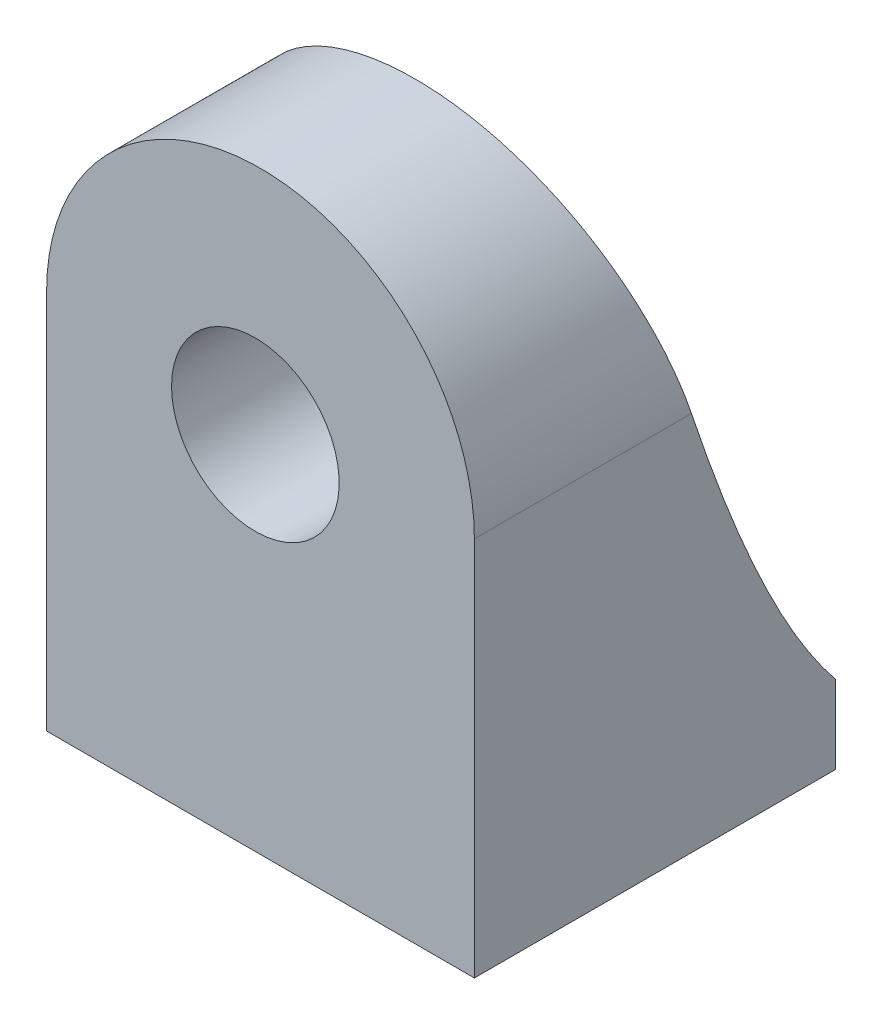
ISO-10303-21;
HEADER;
FILE_DESCRIPTION(('STEP AP214'),'2;1');
FILE_NAME('part.step','',(''),(''),'','','');
FILE_SCHEMA(('AUTOMOTIVE_DESIGN { 1 0 10303 214 1 1 1 1 }'));
ENDSEC;
DATA;
#1=APPLICATION_CONTEXT('core data for automotive mechanical design processes');
#2=APPLICATION_PROTOCOL_DEFINITION('international standard','automotive_design',2000,#1);
#3=PRODUCT_CONTEXT('',#1,'mechanical');
#4=PRODUCT('Part','Part','',(#3));
#5=PRODUCT_RELATED_PRODUCT_CATEGORY('part','',(#4));
#6=PRODUCT_DEFINITION_FORMATION('','',#4);
#7=PRODUCT_DEFINITION_CONTEXT('part definition',#1,'design');
#8=PRODUCT_DEFINITION('design','',#6,#7);
#9=PRODUCT_DEFINITION_SHAPE('','',#8);
#10=(LENGTH_UNIT() NAMED_UNIT(*) SI_UNIT(.MILLI.,.METRE.));
#11=(NAMED_UNIT(*) PLANE_ANGLE_UNIT() SI_UNIT($,.RADIAN.));
#12=(NAMED_UNIT(*) SI_UNIT($,.STERADIAN.) SOLID_ANGLE_UNIT());
#13=UNCERTAINTY_MEASURE_WITH_UNIT(LENGTH_MEASURE(1.E-05),#10,'distance_accuracy_value','');
#14=(GEOMETRIC_REPRESENTATION_CONTEXT(3) GLOBAL_UNCERTAINTY_ASSIGNED_CONTEXT((#13)) GLOBAL_UNIT_ASSIGNED_CONTEXT((#10,
#11,#12)) REPRESENTATION_CONTEXT('',''));
#15=CARTESIAN_POINT('',(0.,0.,0.));
#16=DIRECTION('',(0.,0.,1.));
#17=DIRECTION('',(1.,0.,0.));
#18=AXIS2_PLACEMENT_3D('',#15,#16,#17);
#19=CARTESIAN_POINT('',(-10.1213010765894,-33.8275579371165,28.));
#20=DIRECTION('',(0.,1.,0.));
#21=DIRECTION('',(0.,0.,1.));
#22=AXIS2_PLACEMENT_3D('',#19,#20,#21);
#23=PLANE('',#22);
#24=CARTESIAN_POINT('',(6.46731545091811,-33.8275579371165,8.5));
#25=DIRECTION('',(0.,1.,0.));
#26=DIRECTION('',(0.,0.,1.));
#27=AXIS2_PLACEMENT_3D('',#24,#25,#26);
#28=CIRCLE('',#27,7.);
#29=CARTESIAN_POINT('',(6.46731545091811,-33.8275579371165,15.5));
#30=VERTEX_POINT('',#29);
#31=EDGE_CURVE('E228',#30,#30,#28,.T.);
#32=ORIENTED_EDGE('',*,*,#31,.T.);
#33=EDGE_LOOP('',(#32));
#34=FACE_BOUND('',#33,.T.);
#35=DIRECTION('',(1.,0.,0.));
#36=VECTOR('',#35,1.);
#37=CARTESIAN_POINT('',(-10.1213010765894,-33.8275579371165,0.));
#38=LINE('',#37,#36);
#39=CARTESIAN_POINT('',(-10.1213010765894,-33.8275579371165,0.));
#40=VERTEX_POINT('',#39);
#41=CARTESIAN_POINT('',(23.0559319784256,-33.8275579371165,0.));
#42=VERTEX_POINT('',#41);
#43=EDGE_CURVE('E233',#40,#42,#38,.T.);
#44=ORIENTED_EDGE('',*,*,#43,.T.);
#45=DIRECTION('',(0.,0.,-1.));
#46=VECTOR('',#45,1.);
#47=CARTESIAN_POINT('',(23.0559319784256,-33.8275579371165,28.));
#48=LINE('',#47,#46);
#49=CARTESIAN_POINT('',(23.0559319784256,-33.8275579371165,28.));
#50=VERTEX_POINT('',#49);
#51=EDGE_CURVE('E236',#50,#42,#48,.T.);
#52=ORIENTED_EDGE('',*,*,#51,.F.);
#53=DIRECTION('',(1.,0.,0.));
#54=VECTOR('',#53,1.);
#55=CARTESIAN_POINT('',(-10.1213010765894,-33.8275579371165,28.));
#56=LINE('',#55,#54);
#57=CARTESIAN_POINT('',(-10.1213010765894,-33.8275579371165,28.));
#58=VERTEX_POINT('',#57);
#59=EDGE_CURVE('E251',#58,#50,#56,.T.);
#60=ORIENTED_EDGE('',*,*,#59,.F.);
#61=DIRECTION('',(0.,0.,-1.));
#62=VECTOR('',#61,1.);
#63=CARTESIAN_POINT('',(-10.1213010765894,-33.8275579371165,28.));
#64=LINE('',#63,#62);
#65=EDGE_CURVE('E238',#58,#40,#64,.T.);
#66=ORIENTED_EDGE('',*,*,#65,.T.);
#67=EDGE_LOOP('',(#44,#52,#60,#66));
#68=FACE_BOUND('',#67,.T.);
#69=ADVANCED_FACE('F32',(#34,#68),#23,.F.);
#70=CARTESIAN_POINT('',(23.0559319784256,-33.8275579371165,28.));
#71=DIRECTION('',(-1.,0.,0.));
#72=DIRECTION('',(0.,0.,1.));
#73=AXIS2_PLACEMENT_3D('',#70,#71,#72);
#74=PLANE('',#73);
#75=DIRECTION('',(0.,1.,0.));
#76=VECTOR('',#75,1.);
#77=CARTESIAN_POINT('',(23.0559319784256,-33.8275579371165,0.));
#78=LINE('',#77,#76);
#79=CARTESIAN_POINT('',(23.0559319784256,-27.7389412307951,0.));
#80=VERTEX_POINT('',#79);
#81=EDGE_CURVE('E240',#42,#80,#78,.T.);
#82=ORIENTED_EDGE('',*,*,#81,.T.);
#83=CARTESIAN_POINT('',(23.0559319784256,12.2610587692049,16.));
#84=CARTESIAN_POINT('',(23.0559319784256,-17.773605896721,8.21352778718762));
#85=CARTESIAN_POINT('',(23.0559319784256,-27.7389412307951,0.));
#86=B_SPLINE_CURVE_WITH_KNOTS('',2,(#83,#84,#85),.UNSPECIFIED.,.F.,.F.,(3,3),(0.,1.),.UNSPECIFIED.);
#87=CARTESIAN_POINT('',(23.0559319784256,-4.32755775830468,11.1659683658514));
#88=VERTEX_POINT('',#87);
#89=EDGE_CURVE('E146',#88,#80,#86,.T.);
#90=ORIENTED_EDGE('',*,*,#89,.F.);
#91=DIRECTION('',(0.,0.,-1.));
#92=VECTOR('',#91,1.);
#93=CARTESIAN_POINT('',(23.0559319784256,-4.3275577583026,28.));
#94=LINE('',#93,#92);
#95=CARTESIAN_POINT('',(23.0559319784256,-4.3275577583026,28.));
#96=VERTEX_POINT('',#95);
#97=EDGE_CURVE('E256',#96,#88,#94,.T.);
#98=ORIENTED_EDGE('',*,*,#97,.F.);
#99=DIRECTION('',(0.,1.,0.));
#100=VECTOR('',#99,1.);
#101=CARTESIAN_POINT('',(23.0559319784256,-33.8275579371165,28.));
#102=LINE('',#101,#100);
#103=EDGE_CURVE('E270',#50,#96,#102,.T.);
#104=ORIENTED_EDGE('',*,*,#103,.F.);
#105=ORIENTED_EDGE('',*,*,#51,.T.);
#106=EDGE_LOOP('',(#82,#90,#98,#104,#105));
#107=FACE_BOUND('',#106,.T.);
#108=ADVANCED_FACE('F218',(#107),#74,.F.);
#109=CARTESIAN_POINT('',(6.46731545091811,-4.3275577583026,28.));
#110=DIRECTION('',(0.,0.,-1.));
#111=DIRECTION('',(-1.,0.,0.));
#112=AXIS2_PLACEMENT_3D('',#109,#110,#111);
#113=CYLINDRICAL_SURFACE('',#112,16.5886165275075);
#114=ORIENTED_EDGE('',*,*,#97,.T.);
#115=CARTESIAN_POINT('',(23.0559319784256,-4.32755775830259,11.1659683658521));
#116=CARTESIAN_POINT('',(23.0559404042279,-4.0099077870074,11.2713960177065));
#117=CARTESIAN_POINT('',(23.0468083235614,-3.69196982055232,11.375971548117));
#118=CARTESIAN_POINT('',(23.0102227149126,-3.05647258385653,11.5832058672955));
#119=CARTESIAN_POINT('',(22.9827664937862,-2.73891337615675,11.6858643720333));
#120=CARTESIAN_POINT('',(22.9094906337039,-2.10520925660012,11.8890251998942));
#121=CARTESIAN_POINT('',(22.8636702374133,-1.78906440361471,11.9895274339131));
#122=CARTESIAN_POINT('',(22.7536387600845,-1.15891997961084,12.1882501591669));
#123=CARTESIAN_POINT('',(22.6894098580009,-0.844922790774588,12.2864683391392));
#124=CARTESIAN_POINT('',(22.5426567783226,-0.220433957272384,12.4803070067005));
#125=CARTESIAN_POINT('',(22.4601336355078,0.0900578846235466,12.5759276408716));
#126=CARTESIAN_POINT('',(22.2769348697158,0.706480193205333,12.7643657392493));
#127=CARTESIAN_POINT('',(22.1762595219557,1.0124107289719,12.8571832459308));
#128=CARTESIAN_POINT('',(21.9018740420253,1.77088094807527,13.0856762405501));
#129=CARTESIAN_POINT('',(21.7168667605052,2.21994720171406,13.219483731978));
#130=CARTESIAN_POINT('',(21.3071730266504,3.10192787750556,13.4797195931414));
#131=CARTESIAN_POINT('',(21.0824824394597,3.53484061082102,13.6061471920907));
#132=CARTESIAN_POINT('',(20.716808629431,4.16913070851716,13.7897175607214));
#133=CARTESIAN_POINT('',(20.5901715007344,4.37800881867717,13.8498848479598));
#134=CARTESIAN_POINT('',(20.3275530718905,4.79032263213336,13.9681316218233));
#135=CARTESIAN_POINT('',(20.1915744387556,4.99375986595229,14.0262116971969));
#136=CARTESIAN_POINT('',(19.7698524802135,5.5953684388619,14.1972473130899));
#137=CARTESIAN_POINT('',(19.4702903041219,5.98489358165475,14.307014690443));
#138=CARTESIAN_POINT('',(18.8461179684074,6.72572020423243,14.5142224928528));
#139=CARTESIAN_POINT('',(18.5225473018516,7.07782409974685,14.611936370157));
#140=CARTESIAN_POINT('',(17.8448629948672,7.75394274421132,14.7983509708212));
#141=CARTESIAN_POINT('',(17.4907497595995,8.07795786565739,14.8870518137092));
#142=CARTESIAN_POINT('',(16.7543978570056,8.69507382789501,15.0550202757061));
#143=CARTESIAN_POINT('',(16.3721565487333,8.98817175956737,15.1342870072124));
#144=CARTESIAN_POINT('',(15.5823264762451,9.54078928349672,15.2829940823842));
#145=CARTESIAN_POINT('',(15.1747384443118,9.80030984515819,15.3524347097424));
#146=CARTESIAN_POINT('',(14.3530767001304,10.2742694051698,15.4787175602777));
#147=CARTESIAN_POINT('',(13.9398286390096,10.4900403846532,15.5359364116899));
#148=CARTESIAN_POINT('',(13.0956222672908,10.8864219525492,15.6406962845602));
#149=CARTESIAN_POINT('',(12.6646644025182,11.0670334254093,15.6882375494621));
#150=CARTESIAN_POINT('',(11.7882749196504,11.3914712962285,15.7734109051191));
#151=CARTESIAN_POINT('',(11.3428465032123,11.535305769584,15.8110451712805));
#152=CARTESIAN_POINT('',(10.4407389433407,11.7849566889445,15.8762400049499));
#153=CARTESIAN_POINT('',(9.98405996712041,11.8907736996261,15.9038007220813));
#154=CARTESIAN_POINT('',(9.07522560622303,12.0611277375898,15.9481165670038));
#155=CARTESIAN_POINT('',(8.62327576363793,12.126692866636,15.9651409131001));
#156=CARTESIAN_POINT('',(7.71525404310328,12.2203470832181,15.9894463707967));
#157=CARTESIAN_POINT('',(7.25918224804334,12.2484369226754,15.9967276778857));
#158=CARTESIAN_POINT('',(6.34624770280907,12.2668985950781,16.0015140506717));
#159=CARTESIAN_POINT('',(5.88938499191463,12.257272250316,15.999019588694));
#160=CARTESIAN_POINT('',(4.97816704175231,12.200388893147,15.984266879892));
#161=CARTESIAN_POINT('',(4.52381179744932,12.1531319563316,15.972008652681));
#162=CARTESIAN_POINT('',(3.62569507843145,12.0220952685796,15.9379661443255));
#163=CARTESIAN_POINT('',(3.18187235595505,11.9387081711366,15.9162842693332));
#164=CARTESIAN_POINT('',(2.30303269431269,11.7361991690905,15.8635142848371));
#165=CARTESIAN_POINT('',(1.86801566531177,11.6170776292436,15.8324262713456));
#166=CARTESIAN_POINT('',(1.00981344367835,11.344092703159,15.7609813771844));
#167=CARTESIAN_POINT('',(0.586628136628337,11.1902296530165,15.7206245861822));
#168=CARTESIAN_POINT('',(-0.245023751308105,10.8490268933669,15.6308180559521));
#169=CARTESIAN_POINT('',(-0.6534902083695,10.661686902308,15.5813682402487));
#170=CARTESIAN_POINT('',(-1.45574295192818,10.2536381755132,15.4732148766664));
#171=CARTESIAN_POINT('',(-1.84940765678926,10.0327068412669,15.4144494777638));
#172=CARTESIAN_POINT('',(-2.61643021635978,9.56023031125116,15.2881697154123));
#173=CARTESIAN_POINT('',(-2.9897880396067,9.30868506805192,15.2206553384087));
#174=CARTESIAN_POINT('',(-3.71380489914597,8.77697273201701,15.0771642761992));
#175=CARTESIAN_POINT('',(-4.0644636770897,8.49680531351231,15.0011874947054));
#176=CARTESIAN_POINT('',(-4.74090749538244,7.91002448536246,14.8410907318108));
#177=CARTESIAN_POINT('',(-5.06669218588646,7.60341070388794,14.7569706359151));
#178=CARTESIAN_POINT('',(-5.69851651599032,6.95884868566392,14.5789427244066));
#179=CARTESIAN_POINT('',(-6.00394300551781,6.62034863573502,14.4848565822653));
#180=CARTESIAN_POINT('',(-6.58494414247368,5.92073408100539,14.2889315738754));
#181=CARTESIAN_POINT('',(-6.86051823917139,5.55961915918897,14.1870925646575));
#182=CARTESIAN_POINT('',(-7.38036169278473,4.81735412547345,13.9760512338411));
#183=CARTESIAN_POINT('',(-7.624619436795,4.43619665474277,13.8668462035109));
#184=CARTESIAN_POINT('',(-8.08042470488556,3.65675657070566,13.6415606941407));
#185=CARTESIAN_POINT('',(-8.29197246693259,3.25847408201153,13.5254802651281));
#186=CARTESIAN_POINT('',(-8.68810904967978,2.43350139968781,13.2827715957788));
#187=CARTESIAN_POINT('',(-8.87150407495312,2.00630496340003,13.1559169033456));
#188=CARTESIAN_POINT('',(-9.20133118253463,1.13967419641744,12.8958912110549));
#189=CARTESIAN_POINT('',(-9.3477619589751,0.700239433977544,12.7627199882454));
#190=CARTESIAN_POINT('',(-9.53915849210152,0.0345850376096049,12.5587641448418));
#191=CARTESIAN_POINT('',(-9.5982358373247,-0.188316950351225,12.4900998426016));
#192=CARTESIAN_POINT('',(-9.70695901632358,-0.635934728594647,12.3514386867631));
#193=CARTESIAN_POINT('',(-9.75660707699137,-0.860650077518243,12.2814421521021));
#194=CARTESIAN_POINT('',(-9.89133650989501,-1.53688681779601,12.0695848612886));
#195=CARTESIAN_POINT('',(-9.96226720601358,-1.99072220790621,11.9257880824168));
#196=CARTESIAN_POINT('',(-10.0499976349345,-2.75911371795729,11.6793448817735));
#197=CARTESIAN_POINT('',(-10.0767808336162,-3.07295726434161,11.5778537759612));
#198=CARTESIAN_POINT('',(-10.1124169537625,-3.70046579413187,11.3731765242939));
#199=CARTESIAN_POINT('',(-10.1213029587249,-4.01413003352103,11.2699938620982));
#200=CARTESIAN_POINT('',(-10.1213010765894,-4.3275577583026,11.1659683658521));
#201=B_SPLINE_CURVE_WITH_KNOTS('',3,(#115,#116,#117,#118,#119,#120,#121,#122,#123,#124,#125,
#126,#127,#128,#129,#130,#131,#132,#133,#134,#135,#136,#137,#138,#139,#140,#141,#142,#143,#144,
#145,#146,#147,#148,#149,#150,#151,#152,#153,#154,#155,#156,#157,#158,#159,#160,#161,#162,#163,
#164,#165,#166,#167,#168,#169,#170,#171,#172,#173,#174,#175,#176,#177,#178,#179,#180,#181,#182,
#183,#184,#185,#186,#187,#188,#189,#190,#191,#192,#193,#194,#195,#196,#197,#198,#199,#200),
.UNSPECIFIED.,.F.,.F.,(4,2,2,2,2,2,2,2,2,2,2,2,2,2,2,2,2,2,2,2,2,2,2,2,2,2,2,2,2,2,2,2,2,2,2,2,
2,2,2,2,2,2,4),(0.,1.00394750496019,2.00804259506648,3.01217909810382,4.01729099581358,
5.02234605572338,6.02738587864018,7.53680229290818,9.04637607576254,9.80087256767126,
10.5551545378938,12.0635159990641,13.5259817544751,14.9884281125985,16.4510119554962,
17.9135535630477,19.3208850776854,20.7281811859256,22.1351680179241,23.5421339509626,
24.9114800997371,26.280798772912,27.6500512869943,29.0193010505596,30.3740294004218,
31.7287439224848,33.083445339378,34.4381581502865,35.8022745345513,37.166393032253,
38.5305270529061,39.8946802560746,41.289683665334,42.6847128058771,44.0802577718461,
45.4757925846781,46.9198729731786,48.3640043708081,49.0856456667881,49.8071163219231,
51.2493332217117,52.2416831597307,53.2321970193783),.UNSPECIFIED.);
#202=CARTESIAN_POINT('',(-10.1213010765894,-4.32755775830468,11.1659683658515));
#203=VERTEX_POINT('',#202);
#204=EDGE_CURVE('E178',#88,#203,#201,.T.);
#205=ORIENTED_EDGE('',*,*,#204,.T.);
#206=DIRECTION('',(0.,0.,-1.));
#207=VECTOR('',#206,1.);
#208=CARTESIAN_POINT('',(-10.1213010765894,-4.3275577583026,28.));
#209=LINE('',#208,#207);
#210=CARTESIAN_POINT('',(-10.1213010765894,-4.3275577583026,28.));
#211=VERTEX_POINT('',#210);
#212=EDGE_CURVE('E253',#211,#203,#209,.T.);
#213=ORIENTED_EDGE('',*,*,#212,.F.);
#214=CARTESIAN_POINT('',(6.46731545091811,-4.3275577583026,28.));
#215=DIRECTION('',(0.,0.,1.));
#216=DIRECTION('',(1.,0.,0.));
#217=AXIS2_PLACEMENT_3D('',#214,#215,#216);
#218=CIRCLE('',#217,16.5886165275075);
#219=EDGE_CURVE('E268',#96,#211,#218,.T.);
#220=ORIENTED_EDGE('',*,*,#219,.F.);
#221=EDGE_LOOP('',(#114,#205,#213,#220));
#222=FACE_BOUND('',#221,.T.);
#223=ADVANCED_FACE('F223',(#222),#113,.T.);
#224=CARTESIAN_POINT('',(-10.1213010765894,-4.3275577583026,28.));
#225=DIRECTION('',(1.,0.,0.));
#226=DIRECTION('',(0.,0.,-1.));
#227=AXIS2_PLACEMENT_3D('',#224,#225,#226);
#228=PLANE('',#227);
#229=ORIENTED_EDGE('',*,*,#212,.T.);
#230=CARTESIAN_POINT('',(-10.1213010765894,12.2610587692049,16.));
#231=CARTESIAN_POINT('',(-10.1213010765894,-17.773605896721,8.21352778718762));
#232=CARTESIAN_POINT('',(-10.1213010765894,-27.7389412307951,0.));
#233=B_SPLINE_CURVE_WITH_KNOTS('',2,(#230,#231,#232),.UNSPECIFIED.,.F.,.F.,(3,3),(0.,1.),.UNSPECIFIED.);
#234=CARTESIAN_POINT('',(-10.1213010765894,-27.7389412307951,0.));
#235=VERTEX_POINT('',#234);
#236=EDGE_CURVE('E151',#203,#235,#233,.T.);
#237=ORIENTED_EDGE('',*,*,#236,.T.);
#238=DIRECTION('',(0.,-1.,0.));
#239=VECTOR('',#238,1.);
#240=CARTESIAN_POINT('',(-10.1213010765894,-4.3275577583026,0.));
#241=LINE('',#240,#239);
#242=EDGE_CURVE('E243',#235,#40,#241,.T.);
#243=ORIENTED_EDGE('',*,*,#242,.T.);
#244=ORIENTED_EDGE('',*,*,#65,.F.);
#245=DIRECTION('',(0.,-1.,0.));
#246=VECTOR('',#245,1.);
#247=CARTESIAN_POINT('',(-10.1213010765894,-4.3275577583026,28.));
#248=LINE('',#247,#246);
#249=EDGE_CURVE('E247',#211,#58,#248,.T.);
#250=ORIENTED_EDGE('',*,*,#249,.F.);
#251=EDGE_LOOP('',(#229,#237,#243,#244,#250));
#252=FACE_BOUND('',#251,.T.);
#253=ADVANCED_FACE('F261',(#252),#228,.F.);
#254=CARTESIAN_POINT('',(6.46731545091811,-4.3275577583026,28.));
#255=DIRECTION('',(0.,0.,1.));
#256=DIRECTION('',(1.,0.,0.));
#257=AXIS2_PLACEMENT_3D('',#254,#255,#256);
#258=PLANE('',#257);
#259=CARTESIAN_POINT('',(6.06871416090005,-5.82755793711653,28.));
#260=DIRECTION('',(0.,0.,-1.));
#261=DIRECTION('',(-1.,0.,0.));
#262=AXIS2_PLACEMENT_3D('',#259,#260,#261);
#263=CIRCLE('',#262,6.5);
#264=CARTESIAN_POINT('',(-0.431285839099954,-5.82755793711653,28.));
#265=VERTEX_POINT('',#264);
#266=EDGE_CURVE('E137',#265,#265,#263,.T.);
#267=ORIENTED_EDGE('',*,*,#266,.T.);
#268=EDGE_LOOP('',(#267));
#269=FACE_BOUND('',#268,.T.);
#270=ORIENTED_EDGE('',*,*,#59,.T.);
#271=ORIENTED_EDGE('',*,*,#103,.T.);
#272=ORIENTED_EDGE('',*,*,#219,.T.);
#273=ORIENTED_EDGE('',*,*,#249,.T.);
#274=EDGE_LOOP('',(#270,#271,#272,#273));
#275=FACE_BOUND('',#274,.T.);
#276=ADVANCED_FACE('F173',(#269,#275),#258,.T.);
#277=CARTESIAN_POINT('',(6.46731545091811,-4.3275577583026,0.));
#278=DIRECTION('',(0.,0.,1.));
#279=DIRECTION('',(1.,0.,0.));
#280=AXIS2_PLACEMENT_3D('',#277,#278,#279);
#281=PLANE('',#280);
#282=DIRECTION('',(-1.,0.,0.));
#283=VECTOR('',#282,1.);
#284=CARTESIAN_POINT('',(20.0559319784256,-28.8275579371165,0.));
#285=LINE('',#284,#283);
#286=CARTESIAN_POINT('',(20.0559319784256,-28.8275579371165,0.));
#287=VERTEX_POINT('',#286);
#288=CARTESIAN_POINT('',(-7.1213010765894,-28.8275579371165,0.));
#289=VERTEX_POINT('',#288);
#290=EDGE_CURVE('E118',#287,#289,#285,.T.);
#291=ORIENTED_EDGE('',*,*,#290,.F.);
#292=DIRECTION('',(0.,-1.,0.));
#293=VECTOR('',#292,1.);
#294=CARTESIAN_POINT('',(20.0559319784256,-28.8275579371165,0.));
#295=LINE('',#294,#293);
#296=CARTESIAN_POINT('',(20.0559319784256,-27.7389412307951,0.));
#297=VERTEX_POINT('',#296);
#298=EDGE_CURVE('E133',#297,#287,#295,.T.);
#299=ORIENTED_EDGE('',*,*,#298,.F.);
#300=DIRECTION('',(1.,0.,0.));
#301=VECTOR('',#300,1.);
#302=CARTESIAN_POINT('',(-10.1213010765894,-27.7389412307951,0.));
#303=LINE('',#302,#301);
#304=EDGE_CURVE('E55',#297,#80,#303,.T.);
#305=ORIENTED_EDGE('',*,*,#304,.T.);
#306=ORIENTED_EDGE('',*,*,#81,.F.);
#307=ORIENTED_EDGE('',*,*,#43,.F.);
#308=ORIENTED_EDGE('',*,*,#242,.F.);
#309=CARTESIAN_POINT('',(-7.1213010765894,-27.7389412307951,0.));
#310=VERTEX_POINT('',#309);
#311=EDGE_CURVE('E245',#235,#310,#303,.T.);
#312=ORIENTED_EDGE('',*,*,#311,.T.);
#313=DIRECTION('',(0.,1.,0.));
#314=VECTOR('',#313,1.);
#315=CARTESIAN_POINT('',(-7.1213010765894,-5.82755793711653,0.));
#316=LINE('',#315,#314);
#317=EDGE_CURVE('E47',#289,#310,#316,.T.);
#318=ORIENTED_EDGE('',*,*,#317,.F.);
#319=EDGE_LOOP('',(#291,#299,#305,#306,#307,#308,#312,#318));
#320=FACE_BOUND('',#319,.T.);
#321=ADVANCED_FACE('F170',(#320),#281,.F.);
#322=DIRECTION('',(1.,0.,0.));
#323=VECTOR('',#322,1.);
#324=SURFACE_OF_LINEAR_EXTRUSION('',#233,#323);
#325=ORIENTED_EDGE('',*,*,#304,.F.);
#326=CARTESIAN_POINT('',(20.0559319784256,-27.7389412307951,0.));
#327=CARTESIAN_POINT('',(20.0559319784256,-27.5832934315625,0.128278954570806));
#328=CARTESIAN_POINT('',(20.0559319784256,-27.4261394844472,0.254710735935313));
#329=CARTESIAN_POINT('',(20.0559319784256,-27.1091112858626,0.504090951188082));
#330=CARTESIAN_POINT('',(20.0559319784256,-26.9492372620267,0.62703967428813));
#331=CARTESIAN_POINT('',(20.0559319784256,-26.4668192409932,0.990342366015565));
#332=CARTESIAN_POINT('',(20.0559319784256,-26.1406206936076,1.22585544178286));
#333=CARTESIAN_POINT('',(20.0559319784256,-25.480721071626,1.68509302021906));
#334=CARTESIAN_POINT('',(20.0559319784256,-25.1470306243642,1.90883288100452));
#335=CARTESIAN_POINT('',(20.0559319784256,-24.4732270453663,2.34601989969117));
#336=CARTESIAN_POINT('',(20.0559319784256,-24.1331172268646,2.55947217552835));
#337=CARTESIAN_POINT('',(20.0559319784256,-23.4473753340077,2.9772675557116));
#338=CARTESIAN_POINT('',(20.0559319784256,-23.1017434095673,3.1816109067787));
#339=CARTESIAN_POINT('',(20.0559319784256,-22.4079702931674,3.58084849513516));
#340=CARTESIAN_POINT('',(20.0559319784256,-22.0598586308826,3.77579415461644));
#341=CARTESIAN_POINT('',(20.0559319784256,-21.3594914166502,4.15845627923551));
#342=CARTESIAN_POINT('',(20.0559319784256,-21.0072340986233,4.34616950618234));
#343=CARTESIAN_POINT('',(20.0559319784256,-20.2991212671046,4.71501350888147));
#344=CARTESIAN_POINT('',(20.0559319784256,-19.9432644080328,4.896141697303));
#345=CARTESIAN_POINT('',(20.0559319784256,-19.2284452248969,5.25235705232105));
#346=CARTESIAN_POINT('',(20.0559319784256,-18.8694822279383,5.4274428667667));
#347=CARTESIAN_POINT('',(20.0559319784256,-18.1489016815077,5.77203148179204));
#348=CARTESIAN_POINT('',(20.0559319784256,-17.7872842039176,5.94153443287582));
#349=CARTESIAN_POINT('',(20.0559319784256,-17.0481717888453,6.28162509474026));
#350=CARTESIAN_POINT('',(20.0559319784256,-16.6705872654304,6.45201793071061));
#351=CARTESIAN_POINT('',(20.0559319784256,-15.9132605711672,6.78767102266519));
#352=CARTESIAN_POINT('',(20.0559319784256,-15.5335189704058,6.95293256635679));
#353=CARTESIAN_POINT('',(20.0559319784256,-14.7720755310823,7.27872917263206));
#354=CARTESIAN_POINT('',(20.0559319784256,-14.3903739614582,7.43926486434211));
#355=CARTESIAN_POINT('',(20.0559319784256,-13.6251863711836,7.75596351462836));
#356=CARTESIAN_POINT('',(20.0559319784256,-13.2417004464979,7.9121267052646));
#357=CARTESIAN_POINT('',(20.0559319784256,-12.4731017192146,8.22039071006377));
#358=CARTESIAN_POINT('',(20.0559319784256,-12.0879889209537,8.3724915350476));
#359=CARTESIAN_POINT('',(20.0559319784256,-11.3137371424935,8.67389429002025));
#360=CARTESIAN_POINT('',(20.0559319784256,-10.9245883771277,8.82317106689591));
#361=CARTESIAN_POINT('',(20.0559319784256,-10.1449172707697,9.11813504598521));
#362=CARTESIAN_POINT('',(20.0559319784256,-9.75439487955344,9.26382211535573));
#363=CARTESIAN_POINT('',(20.0559319784256,-8.97210024050609,9.55182665548426));
#364=CARTESIAN_POINT('',(20.0559319784256,-8.58032796474554,9.69414405033778));
#365=CARTESIAN_POINT('',(20.0559319784256,-7.79564964727284,9.97560717730306));
#366=CARTESIAN_POINT('',(20.0559319784256,-7.40274361349256,10.1147529315435));
#367=CARTESIAN_POINT('',(20.0559319784256,-6.61590385707691,10.3900463574735));
#368=CARTESIAN_POINT('',(20.0559319784256,-6.22197018546655,10.5261941749647));
#369=CARTESIAN_POINT('',(20.0559319784256,-5.82755793711653,10.6609360700749));
#370=B_SPLINE_CURVE_WITH_KNOTS('',3,(#326,#327,#328,#329,#330,#331,#332,#333,#334,#335,#336,
#337,#338,#339,#340,#341,#342,#343,#344,#345,#346,#347,#348,#349,#350,#351,#352,#353,#354,#355,
#356,#357,#358,#359,#360,#361,#362,#363,#364,#365,#366,#367,#368,#369),.UNSPECIFIED.,.F.,.F.,(4,
2,2,2,2,2,2,2,2,2,2,2,2,2,2,2,2,2,2,2,2,4),(0.,0.605056847261968,1.2100633061791,
2.41675060711128,3.62182264326782,4.82628884962168,6.03072241239607,7.22756748958999,
8.42494234873979,9.62278269349198,10.8208893731104,12.0189637274203,13.2616752941149,
14.5040724372238,15.7463034320296,16.9884683729455,18.2306300047837,19.4810040844268,
20.7314243669644,21.9818727894241,23.232312484763,24.4826912312582),.UNSPECIFIED.);
#371=CARTESIAN_POINT('',(20.0559319784256,-5.82755793711653,10.6609360700749));
#372=VERTEX_POINT('',#371);
#373=EDGE_CURVE('E11',#297,#372,#370,.T.);
#374=ORIENTED_EDGE('',*,*,#373,.T.);
#375=CARTESIAN_POINT('',(20.0559319784256,-5.82755793711653,10.6609360700749));
#376=CARTESIAN_POINT('',(20.0559385362506,-5.56634253161466,10.7501741336219));
#377=CARTESIAN_POINT('',(20.0484000811584,-5.30491057957283,10.8387904349182));
#378=CARTESIAN_POINT('',(20.0182038333992,-4.78239250233877,11.014583014885));
#379=CARTESIAN_POINT('',(19.9955437554416,-4.52130643539595,11.1017590738545));
#380=CARTESIAN_POINT('',(19.9350736283285,-4.00032728689692,11.274451287158));
#381=CARTESIAN_POINT('',(19.8972629261985,-3.74043425724763,11.3599673697822));
#382=CARTESIAN_POINT('',(19.8064647153487,-3.22240537337768,11.5292269016766));
#383=CARTESIAN_POINT('',(19.7534605988055,-2.96427176020968,11.6129683028898));
#384=CARTESIAN_POINT('',(19.63235578946,-2.45090958791284,11.7783818170919));
#385=CARTESIAN_POINT('',(19.5642559583354,-2.19568086384406,11.8600540478947));
#386=CARTESIAN_POINT('',(19.4130752186091,-1.68899365179556,12.0211372458203));
#387=CARTESIAN_POINT('',(19.3299945306949,-1.43753510833521,12.1005482462341));
#388=CARTESIAN_POINT('',(19.1035529375299,-0.814128288582921,12.2961917188545));
#389=CARTESIAN_POINT('',(18.9508654039628,-0.445047747096642,12.4109015498144));
#390=CARTESIAN_POINT('',(18.6127161723235,0.279787624781947,12.6342226201594));
#391=CARTESIAN_POINT('',(18.4272511321327,0.635541091807967,12.7428332361559));
#392=CARTESIAN_POINT('',(18.1253859475436,1.1567247049188,12.9006709839798));
#393=CARTESIAN_POINT('',(18.0208435089446,1.32834418272032,12.9524270976883));
#394=CARTESIAN_POINT('',(17.8040329901537,1.66709123044311,13.0541850285619));
#395=CARTESIAN_POINT('',(17.6917671149836,1.83422006363956,13.1041873403285));
#396=CARTESIAN_POINT('',(17.3435675619699,2.32841985523469,13.2514896122119));
#397=CARTESIAN_POINT('',(17.0962041880752,2.64835209796154,13.3460994201667));
#398=CARTESIAN_POINT('',(16.58122124198,3.25610600834808,13.5246217662323));
#399=CARTESIAN_POINT('',(16.3145141880205,3.54463111955938,13.6087811423669));
#400=CARTESIAN_POINT('',(15.7559027509695,4.09853503513159,13.7694072960612));
#401=CARTESIAN_POINT('',(15.4639987203537,4.36391416317275,13.8458741811972));
#402=CARTESIAN_POINT('',(14.8569830607042,4.86916757832439,13.9907075941352));
#403=CARTESIAN_POINT('',(14.5418696502064,5.10903990416898,14.0590734990837));
#404=CARTESIAN_POINT('',(13.8907223288891,5.56105864331235,14.1873254467811));
#405=CARTESIAN_POINT('',(13.5546891024573,5.77320596292638,14.2472117667283));
#406=CARTESIAN_POINT('',(12.8785948658849,6.15956985133283,14.3558627755167));
#407=CARTESIAN_POINT('',(12.5392829041612,6.33499718474149,14.4049864809994));
#408=CARTESIAN_POINT('',(11.8461748307857,6.65700769306043,14.4948850432001));
#409=CARTESIAN_POINT('',(11.4923791205654,6.80359166674021,14.5356601311207));
#410=CARTESIAN_POINT('',(10.7729753166159,7.06656610771373,14.6086380332124));
#411=CARTESIAN_POINT('',(10.4073700404935,7.18296371810785,14.6408428754367));
#412=CARTESIAN_POINT('',(9.66700298720726,7.38454573204376,14.6965205473253));
#413=CARTESIAN_POINT('',(9.2922413667933,7.46973066952493,14.7199935263612));
#414=CARTESIAN_POINT('',(8.5477772978904,7.60602138165055,14.7575086600666));
#415=CARTESIAN_POINT('',(8.17826111385185,7.65807411703378,14.7718129605988));
#416=CARTESIAN_POINT('',(7.43597583209393,7.73161926994439,14.7920147539002));
#417=CARTESIAN_POINT('',(7.06320680808617,7.75311237817408,14.797912436674));
#418=CARTESIAN_POINT('',(6.31714904157321,7.76534946194013,14.8012708972955));
#419=CARTESIAN_POINT('',(5.94386033049965,7.75609522271,14.798732164973));
#420=CARTESIAN_POINT('',(5.19946147082177,7.7069232089605,14.7852319362644));
#421=CARTESIAN_POINT('',(4.82835131746054,7.66700550142024,14.7742704582762));
#422=CARTESIAN_POINT('',(4.09538205352313,7.55751249388849,14.7441609881542));
#423=CARTESIAN_POINT('',(3.73346542551907,7.48829456593154,14.7251116349324));
#424=CARTESIAN_POINT('',(3.01693647741722,7.32085429958964,14.6789391644403));
#425=CARTESIAN_POINT('',(2.66232407382092,7.22263229296293,14.6518161395191));
#426=CARTESIAN_POINT('',(1.96285993367753,6.99801440778456,14.5896304589306));
#427=CARTESIAN_POINT('',(1.61800811992636,6.87161875215041,14.5545678660832));
#428=CARTESIAN_POINT('',(0.94040325870431,6.59170610812295,14.4766739230902));
#429=CARTESIAN_POINT('',(0.607650328096274,6.43818885784663,14.4338424979295));
#430=CARTESIAN_POINT('',(-0.0461886939488827,6.10394072244591,14.3402388297387));
#431=CARTESIAN_POINT('',(-0.367158280947588,5.92299923115052,14.2894050035702));
#432=CARTESIAN_POINT('',(-0.99245124543548,5.53631084697093,14.1802966472458));
#433=CARTESIAN_POINT('',(-1.29677458964441,5.33056390449668,14.1220221022147));
#434=CARTESIAN_POINT('',(-1.8868549039207,4.89590330734305,13.9983068055769));
#435=CARTESIAN_POINT('',(-2.17261152779927,4.66698922090036,13.9328659204102));
#436=CARTESIAN_POINT('',(-2.72381581966578,4.18777930816947,13.7951225260734));
#437=CARTESIAN_POINT('',(-2.98926316528272,3.93748314261502,13.7228199080271));
#438=CARTESIAN_POINT('',(-3.50484523956637,3.41072102513593,13.5697398703363));
#439=CARTESIAN_POINT('',(-3.75441146432276,3.13374799128683,13.4887924619104));
#440=CARTESIAN_POINT('',(-4.2291027382106,2.56144454440432,13.3204057314775));
#441=CARTESIAN_POINT('',(-4.45422729218217,2.26611375965472,13.2329662780096));
#442=CARTESIAN_POINT('',(-4.87888452169914,1.65919497179931,13.0519651278026));
#443=CARTESIAN_POINT('',(-5.07840725965876,1.34760072149824,12.9584010748952));
#444=CARTESIAN_POINT('',(-5.45073912754922,0.710530716873536,12.7656089455304));
#445=CARTESIAN_POINT('',(-5.623548406351,0.385055039922352,12.6663809006419));
#446=CARTESIAN_POINT('',(-5.94779074637056,-0.290293085582473,12.4587707377021));
#447=CARTESIAN_POINT('',(-6.09814125491435,-0.640622304793951,12.35018312032));
#448=CARTESIAN_POINT('',(-6.36847734603969,-1.35123737785359,12.1278947616952));
#449=CARTESIAN_POINT('',(-6.48846177318081,-1.71152360999131,12.0141938260826));
#450=CARTESIAN_POINT('',(-6.69750093534756,-2.43915450628923,11.7823333396323));
#451=CARTESIAN_POINT('',(-6.78658355490783,-2.80649248963565,11.6641779156644));
#452=CARTESIAN_POINT('',(-6.93367700521471,-3.54591108601203,11.4239161867139));
#453=CARTESIAN_POINT('',(-6.99170076185587,-3.91798966002226,11.3018115477633));
#454=CARTESIAN_POINT('',(-7.06326864859207,-4.54691580450465,11.0932192725496));
#455=CARTESIAN_POINT('',(-7.08506576324963,-4.80315202023885,11.0076245168423));
#456=CARTESIAN_POINT('',(-7.11407004547186,-5.31550663132022,10.8351982135721));
#457=CARTESIAN_POINT('',(-7.1213040533011,-5.5716243720391,10.7483692388299));
#458=CARTESIAN_POINT('',(-7.1213010765894,-5.82755793711653,10.6609360700749));
#459=B_SPLINE_CURVE_WITH_KNOTS('',3,(#375,#376,#377,#378,#379,#380,#381,#382,#383,#384,#385,
#386,#387,#388,#389,#390,#391,#392,#393,#394,#395,#396,#397,#398,#399,#400,#401,#402,#403,#404,
#405,#406,#407,#408,#409,#410,#411,#412,#413,#414,#415,#416,#417,#418,#419,#420,#421,#422,#423,
#424,#425,#426,#427,#428,#429,#430,#431,#432,#433,#434,#435,#436,#437,#438,#439,#440,#441,#442,
#443,#444,#445,#446,#447,#448,#449,#450,#451,#452,#453,#454,#455,#456,#457,#458),.UNSPECIFIED.,
.F.,.F.,(4,2,2,2,2,2,2,2,2,2,2,2,2,2,2,2,2,2,2,2,2,2,2,2,2,2,2,2,2,2,2,2,2,2,2,2,2,2,2,2,2,4),
(0.,0.82801583834005,1.65615684085973,2.48433353915606,3.31341898697653,4.14245712199012,
4.97148304517689,6.21658587343337,7.46181573040883,8.0841751320768,8.70635758320585,
9.95055114177994,11.1545513668074,12.3585347520408,13.5626106469751,14.7666471714785,
15.9205970205072,17.0745149082905,18.22815949095,19.381784337875,20.5007505615346,
21.6196914941517,22.7385674606463,23.8574409831542,24.9630440010656,26.0686343732142,
27.1742159979445,28.2798082986282,29.3943669861541,30.5089279018975,31.6235095934066,
32.7381089731022,33.8813398651302,35.0245939133693,36.1682903925909,37.3119804978971,
38.4998154521522,39.687695597166,40.8745010419771,42.0608121843166,42.8735386248922,
43.6847658086717),.UNSPECIFIED.);
#460=CARTESIAN_POINT('',(-7.1213010765894,-5.82755793711653,10.6609360700749));
#461=VERTEX_POINT('',#460);
#462=EDGE_CURVE('E40',#372,#461,#459,.T.);
#463=ORIENTED_EDGE('',*,*,#462,.T.);
#464=CARTESIAN_POINT('',(-7.1213010765894,-5.82755793711653,10.6609360700749));
#465=CARTESIAN_POINT('',(-7.1213010765894,-6.21063925293094,10.5300654300617));
#466=CARTESIAN_POINT('',(-7.1213010765894,-6.59326888705587,10.3978681687668));
#467=CARTESIAN_POINT('',(-7.1213010765894,-7.35754445598084,10.1306562665451));
#468=CARTESIAN_POINT('',(-7.1213010765894,-7.73919038717269,9.9956416153007));
#469=CARTESIAN_POINT('',(-7.1213010765894,-8.50140633948327,9.72263500010127));
#470=CARTESIAN_POINT('',(-7.1213010765894,-8.88197638598376,9.58464310705815));
#471=CARTESIAN_POINT('',(-7.1213010765894,-9.64193949648773,9.30550050132611));
#472=CARTESIAN_POINT('',(-7.1213010765894,-10.0213326070924,9.16434991557249));
#473=CARTESIAN_POINT('',(-7.1213010765894,-10.7788340693048,8.87868901571113));
#474=CARTESIAN_POINT('',(-7.1213010765894,-11.1569424753097,8.73417884593983));
#475=CARTESIAN_POINT('',(-7.1213010765894,-11.9094049111053,8.44248595028457));
#476=CARTESIAN_POINT('',(-7.1213010765894,-12.2837676225764,8.29532563384709));
#477=CARTESIAN_POINT('',(-7.1213010765894,-13.030987419691,7.99721587880156));
#478=CARTESIAN_POINT('',(-7.1213010765894,-13.4038444878903,7.84626639643841));
#479=CARTESIAN_POINT('',(-7.1213010765894,-14.1479154891054,7.54029893336663));
#480=CARTESIAN_POINT('',(-7.1213010765894,-14.5191293125497,7.38528068599014));
#481=CARTESIAN_POINT('',(-7.1213010765894,-15.2597609033897,7.0708590835359));
#482=CARTESIAN_POINT('',(-7.1213010765894,-15.6291784000165,6.91145509009674));
#483=CARTESIAN_POINT('',(-7.1213010765894,-16.366045817839,6.58790087753383));
#484=CARTESIAN_POINT('',(-7.1213010765894,-16.7334952008374,6.42374943159365));
#485=CARTESIAN_POINT('',(-7.1213010765894,-17.4740576943315,6.08672455769098));
#486=CARTESIAN_POINT('',(-7.1213010765894,-17.847119851741,5.9137390328093));
#487=CARTESIAN_POINT('',(-7.1213010765894,-18.5905244238197,5.56198069577959));
#488=CARTESIAN_POINT('',(-7.1213010765894,-18.9608667467124,5.38320768943278));
#489=CARTESIAN_POINT('',(-7.1213010765894,-19.6983568494103,5.01938814770498));
#490=CARTESIAN_POINT('',(-7.1213010765894,-20.0655053354265,4.83434304590644));
#491=CARTESIAN_POINT('',(-7.1213010765894,-20.79608854476,4.4574044006179));
#492=CARTESIAN_POINT('',(-7.1213010765894,-21.1595247028495,4.26551364250525));
#493=CARTESIAN_POINT('',(-7.1213010765894,-21.8821081736695,3.87419657311958));
#494=CARTESIAN_POINT('',(-7.1213010765894,-22.2412573877831,3.67477377937149));
#495=CARTESIAN_POINT('',(-7.1213010765894,-22.957039561794,3.26618083357206));
#496=CARTESIAN_POINT('',(-7.1213010765894,-23.3136415514014,3.05695630976309));
#497=CARTESIAN_POINT('',(-7.1213010765894,-24.0211067300395,2.62897466304694));
#498=CARTESIAN_POINT('',(-7.1213010765894,-24.3719697775838,2.4102173056055));
#499=CARTESIAN_POINT('',(-7.1213010765894,-25.067006040948,1.96191078505163));
#500=CARTESIAN_POINT('',(-7.1213010765894,-25.4111756971234,1.73235609023209));
#501=CARTESIAN_POINT('',(-7.1213010765894,-26.0916869011934,1.26086404243021));
#502=CARTESIAN_POINT('',(-7.1213010765894,-26.4280168640699,1.01890986898052));
#503=CARTESIAN_POINT('',(-7.1213010765894,-26.925274239284,0.645372446329377));
#504=CARTESIAN_POINT('',(-7.1213010765894,-27.0900522038704,0.518902703175417));
#505=CARTESIAN_POINT('',(-7.1213010765894,-27.4167329395936,0.262275238077643));
#506=CARTESIAN_POINT('',(-7.1213010765894,-27.5786354510338,0.13211718575191));
#507=CARTESIAN_POINT('',(-7.1213010765894,-27.7389412307951,0.));
#508=B_SPLINE_CURVE_WITH_KNOTS('',3,(#464,#465,#466,#467,#468,#469,#470,#471,#472,#473,#474,
#475,#476,#477,#478,#479,#480,#481,#482,#483,#484,#485,#486,#487,#488,#489,#490,#491,#492,#493,
#494,#495,#496,#497,#498,#499,#500,#501,#502,#503,#504,#505,#506,#507),.UNSPECIFIED.,.F.,.F.,(4,
2,2,2,2,2,2,2,2,2,2,2,2,2,2,2,2,2,2,2,2,4),(0.,1.21445669396918,2.42891783620019,
3.64335008426783,4.85773361645929,6.07206507165281,7.2787904127018,8.48552969473545,
9.69234826523139,10.899343431696,12.1066533418396,13.3402587764436,14.5739056476378,
15.8072724267619,17.0401429694495,18.272444702579,19.5126600775226,20.7529059824654,
21.993794364091,23.2364130852598,23.8595174849582,24.4826778770502),.UNSPECIFIED.);
#509=EDGE_CURVE('E187',#461,#310,#508,.T.);
#510=ORIENTED_EDGE('',*,*,#509,.T.);
#511=ORIENTED_EDGE('',*,*,#311,.F.);
#512=ORIENTED_EDGE('',*,*,#236,.F.);
#513=ORIENTED_EDGE('',*,*,#204,.F.);
#514=ORIENTED_EDGE('',*,*,#89,.T.);
#515=EDGE_LOOP('',(#325,#374,#463,#510,#511,#512,#513,#514));
#516=FACE_BOUND('',#515,.T.);
#517=ADVANCED_FACE('F164',(#516),#324,.F.);
#518=CARTESIAN_POINT('',(20.0559319784256,-28.8275579371165,17.));
#519=DIRECTION('',(1.,0.,0.));
#520=DIRECTION('',(0.,0.,-1.));
#521=AXIS2_PLACEMENT_3D('',#518,#519,#520);
#522=PLANE('',#521);
#523=ORIENTED_EDGE('',*,*,#298,.T.);
#524=DIRECTION('',(0.,0.,-1.));
#525=VECTOR('',#524,1.);
#526=CARTESIAN_POINT('',(20.0559319784256,-28.8275579371165,17.));
#527=LINE('',#526,#525);
#528=CARTESIAN_POINT('',(20.0559319784256,-28.8275579371165,17.));
#529=VERTEX_POINT('',#528);
#530=EDGE_CURVE('E144',#529,#287,#527,.T.);
#531=ORIENTED_EDGE('',*,*,#530,.F.);
#532=DIRECTION('',(0.,-1.,0.));
#533=VECTOR('',#532,1.);
#534=CARTESIAN_POINT('',(20.0559319784256,-28.8275579371165,17.));
#535=LINE('',#534,#533);
#536=CARTESIAN_POINT('',(20.0559319784256,-5.82755793711653,17.));
#537=VERTEX_POINT('',#536);
#538=EDGE_CURVE('E120',#537,#529,#535,.T.);
#539=ORIENTED_EDGE('',*,*,#538,.F.);
#540=DIRECTION('',(0.,0.,-1.));
#541=VECTOR('',#540,1.);
#542=CARTESIAN_POINT('',(20.0559319784256,-5.82755793711653,17.));
#543=LINE('',#542,#541);
#544=EDGE_CURVE('E147',#537,#372,#543,.T.);
#545=ORIENTED_EDGE('',*,*,#544,.T.);
#546=ORIENTED_EDGE('',*,*,#373,.F.);
#547=EDGE_LOOP('',(#523,#531,#539,#545,#546));
#548=FACE_BOUND('',#547,.T.);
#549=ADVANCED_FACE('F169',(#548),#522,.F.);
#550=CARTESIAN_POINT('',(6.46731545091811,-5.82755793711653,17.));
#551=DIRECTION('',(0.,0.,-1.));
#552=DIRECTION('',(-1.,0.,0.));
#553=AXIS2_PLACEMENT_3D('',#550,#551,#552);
#554=CYLINDRICAL_SURFACE('',#553,13.5886165275075);
#555=ORIENTED_EDGE('',*,*,#544,.F.);
#556=CARTESIAN_POINT('',(6.46731545091811,-5.82755793711653,17.));
#557=DIRECTION('',(0.,0.,-1.));
#558=DIRECTION('',(-1.,0.,0.));
#559=AXIS2_PLACEMENT_3D('',#556,#557,#558);
#560=CIRCLE('',#559,13.5886165275075);
#561=CARTESIAN_POINT('',(-7.1213010765894,-5.82755793711653,17.));
#562=VERTEX_POINT('',#561);
#563=EDGE_CURVE('E129',#562,#537,#560,.T.);
#564=ORIENTED_EDGE('',*,*,#563,.F.);
#565=DIRECTION('',(0.,0.,-1.));
#566=VECTOR('',#565,1.);
#567=CARTESIAN_POINT('',(-7.1213010765894,-5.82755793711653,17.));
#568=LINE('',#567,#566);
#569=EDGE_CURVE('E119',#562,#461,#568,.T.);
#570=ORIENTED_EDGE('',*,*,#569,.T.);
#571=ORIENTED_EDGE('',*,*,#462,.F.);
#572=EDGE_LOOP('',(#555,#564,#570,#571));
#573=FACE_BOUND('',#572,.T.);
#574=ADVANCED_FACE('F205',(#573),#554,.F.);
#575=CARTESIAN_POINT('',(-7.1213010765894,-5.82755793711653,17.));
#576=DIRECTION('',(-1.,0.,0.));
#577=DIRECTION('',(0.,0.,1.));
#578=AXIS2_PLACEMENT_3D('',#575,#576,#577);
#579=PLANE('',#578);
#580=ORIENTED_EDGE('',*,*,#569,.F.);
#581=DIRECTION('',(0.,1.,0.));
#582=VECTOR('',#581,1.);
#583=CARTESIAN_POINT('',(-7.1213010765894,-5.82755793711653,17.));
#584=LINE('',#583,#582);
#585=CARTESIAN_POINT('',(-7.1213010765894,-28.8275579371165,17.));
#586=VERTEX_POINT('',#585);
#587=EDGE_CURVE('E123',#586,#562,#584,.T.);
#588=ORIENTED_EDGE('',*,*,#587,.F.);
#589=DIRECTION('',(0.,0.,-1.));
#590=VECTOR('',#589,1.);
#591=CARTESIAN_POINT('',(-7.1213010765894,-28.8275579371165,17.));
#592=LINE('',#591,#590);
#593=EDGE_CURVE('E110',#586,#289,#592,.T.);
#594=ORIENTED_EDGE('',*,*,#593,.T.);
#595=ORIENTED_EDGE('',*,*,#317,.T.);
#596=ORIENTED_EDGE('',*,*,#509,.F.);
#597=EDGE_LOOP('',(#580,#588,#594,#595,#596));
#598=FACE_BOUND('',#597,.T.);
#599=ADVANCED_FACE('F124',(#598),#579,.F.);
#600=CARTESIAN_POINT('',(20.0559319784256,-28.8275579371165,17.));
#601=DIRECTION('',(0.,-1.,0.));
#602=DIRECTION('',(0.,0.,-1.));
#603=AXIS2_PLACEMENT_3D('',#600,#601,#602);
#604=PLANE('',#603);
#605=CARTESIAN_POINT('',(6.46731545091811,-28.8275579371165,8.5));
#606=DIRECTION('',(0.,1.,0.));
#607=DIRECTION('',(0.,0.,1.));
#608=AXIS2_PLACEMENT_3D('',#605,#606,#607);
#609=CIRCLE('',#608,7.);
#610=CARTESIAN_POINT('',(6.46731545091811,-28.8275579371165,15.5));
#611=VERTEX_POINT('',#610);
#612=EDGE_CURVE('E284',#611,#611,#609,.T.);
#613=ORIENTED_EDGE('',*,*,#612,.F.);
#614=EDGE_LOOP('',(#613));
#615=FACE_BOUND('',#614,.T.);
#616=ORIENTED_EDGE('',*,*,#290,.T.);
#617=ORIENTED_EDGE('',*,*,#593,.F.);
#618=DIRECTION('',(-1.,0.,0.));
#619=VECTOR('',#618,1.);
#620=CARTESIAN_POINT('',(20.0559319784256,-28.8275579371165,17.));
#621=LINE('',#620,#619);
#622=EDGE_CURVE('E115',#529,#586,#621,.T.);
#623=ORIENTED_EDGE('',*,*,#622,.F.);
#624=ORIENTED_EDGE('',*,*,#530,.T.);
#625=EDGE_LOOP('',(#616,#617,#623,#624));
#626=FACE_BOUND('',#625,.T.);
#627=ADVANCED_FACE('F112',(#615,#626),#604,.F.);
#628=CARTESIAN_POINT('',(6.46731545091811,-5.82755793711653,17.));
#629=DIRECTION('',(0.,0.,-1.));
#630=DIRECTION('',(-1.,0.,0.));
#631=AXIS2_PLACEMENT_3D('',#628,#629,#630);
#632=PLANE('',#631);
#633=CARTESIAN_POINT('',(6.06871416090005,-5.82755793711653,17.));
#634=DIRECTION('',(0.,0.,-1.));
#635=DIRECTION('',(-1.,0.,0.));
#636=AXIS2_PLACEMENT_3D('',#633,#634,#635);
#637=CIRCLE('',#636,6.5);
#638=CARTESIAN_POINT('',(-0.431285839099954,-5.82755793711653,17.));
#639=VERTEX_POINT('',#638);
#640=EDGE_CURVE('E35',#639,#639,#637,.T.);
#641=ORIENTED_EDGE('',*,*,#640,.F.);
#642=EDGE_LOOP('',(#641));
#643=FACE_BOUND('',#642,.T.);
#644=ORIENTED_EDGE('',*,*,#622,.T.);
#645=ORIENTED_EDGE('',*,*,#587,.T.);
#646=ORIENTED_EDGE('',*,*,#563,.T.);
#647=ORIENTED_EDGE('',*,*,#538,.T.);
#648=EDGE_LOOP('',(#644,#645,#646,#647));
#649=FACE_BOUND('',#648,.T.);
#650=ADVANCED_FACE('F131',(#643,#649),#632,.T.);
#651=CARTESIAN_POINT('',(6.06871416090005,-5.82755793711653,28.));
#652=DIRECTION('',(0.,0.,-1.));
#653=DIRECTION('',(-1.,0.,0.));
#654=AXIS2_PLACEMENT_3D('',#651,#652,#653);
#655=CYLINDRICAL_SURFACE('',#654,6.5);
#656=ORIENTED_EDGE('',*,*,#640,.T.);
#657=EDGE_LOOP('',(#656));
#658=FACE_BOUND('',#657,.T.);
#659=ORIENTED_EDGE('',*,*,#266,.F.);
#660=EDGE_LOOP('',(#659));
#661=FACE_BOUND('',#660,.T.);
#662=ADVANCED_FACE('F292',(#658,#661),#655,.F.);
#663=CARTESIAN_POINT('',(6.46731545091811,-38.8275579371165,8.5));
#664=DIRECTION('',(0.,1.,0.));
#665=DIRECTION('',(0.,0.,1.));
#666=AXIS2_PLACEMENT_3D('',#663,#664,#665);
#667=CYLINDRICAL_SURFACE('',#666,7.);
#668=ORIENTED_EDGE('',*,*,#612,.T.);
#669=EDGE_LOOP('',(#668));
#670=FACE_BOUND('',#669,.T.);
#671=ORIENTED_EDGE('',*,*,#31,.F.);
#672=EDGE_LOOP('',(#671));
#673=FACE_BOUND('',#672,.T.);
#674=ADVANCED_FACE('F289',(#670,#673),#667,.F.);
#675=CLOSED_SHELL('',(#69,#108,#223,#253,#276,#321,#517,#549,#574,#599,#627,#650,#662,#674));
#676=MANIFOLD_SOLID_BREP('B2',#675);
#677=ADVANCED_BREP_SHAPE_REPRESENTATION('',(#18,#676),#14);
#678=SHAPE_DEFINITION_REPRESENTATION(#9,#677);
ENDSEC;
END-ISO-10303-21;
